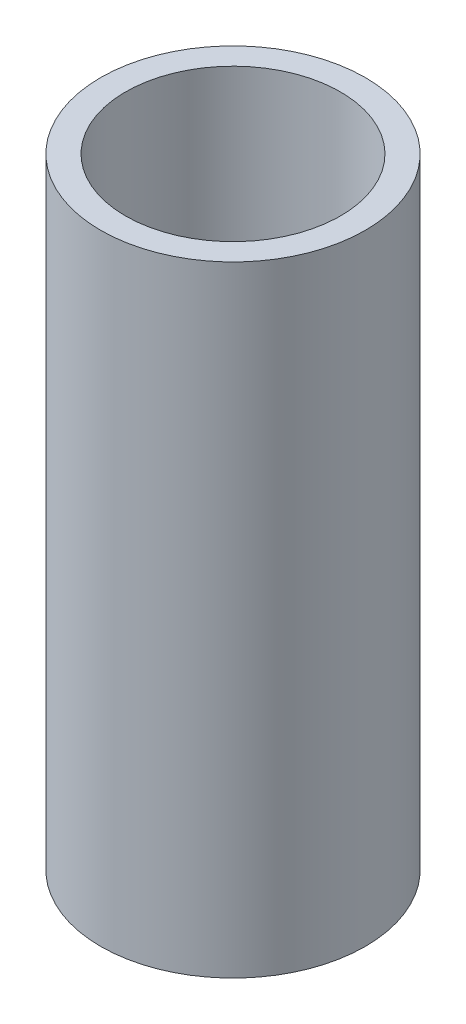
ISO-10303-21;
HEADER;
FILE_DESCRIPTION(('STEP AP214'),'2;1');
FILE_NAME('part.step','',(''),(''),'','','');
FILE_SCHEMA(('AUTOMOTIVE_DESIGN { 1 0 10303 214 1 1 1 1 }'));
ENDSEC;
DATA;
#1=APPLICATION_CONTEXT('core data for automotive mechanical design processes');
#2=APPLICATION_PROTOCOL_DEFINITION('international standard','automotive_design',2000,#1);
#3=PRODUCT_CONTEXT('',#1,'mechanical');
#4=PRODUCT('Part','Part','',(#3));
#5=PRODUCT_RELATED_PRODUCT_CATEGORY('part','',(#4));
#6=PRODUCT_DEFINITION_FORMATION('','',#4);
#7=PRODUCT_DEFINITION_CONTEXT('part definition',#1,'design');
#8=PRODUCT_DEFINITION('design','',#6,#7);
#9=PRODUCT_DEFINITION_SHAPE('','',#8);
#10=(LENGTH_UNIT() NAMED_UNIT(*) SI_UNIT(.MILLI.,.METRE.));
#11=(NAMED_UNIT(*) PLANE_ANGLE_UNIT() SI_UNIT($,.RADIAN.));
#12=(NAMED_UNIT(*) SI_UNIT($,.STERADIAN.) SOLID_ANGLE_UNIT());
#13=UNCERTAINTY_MEASURE_WITH_UNIT(LENGTH_MEASURE(1.E-05),#10,'distance_accuracy_value','');
#14=(GEOMETRIC_REPRESENTATION_CONTEXT(3) GLOBAL_UNCERTAINTY_ASSIGNED_CONTEXT((#13)) GLOBAL_UNIT_ASSIGNED_CONTEXT((#10,
#11,#12)) REPRESENTATION_CONTEXT('',''));
#15=CARTESIAN_POINT('',(0.,0.,0.));
#16=DIRECTION('',(0.,0.,1.));
#17=DIRECTION('',(1.,0.,0.));
#18=AXIS2_PLACEMENT_3D('',#15,#16,#17);
#19=CARTESIAN_POINT('',(0.,82.0234871998214,0.));
#20=DIRECTION('',(0.,-1.,0.));
#21=DIRECTION('',(0.,0.,-1.));
#22=AXIS2_PLACEMENT_3D('',#19,#20,#21);
#23=CYLINDRICAL_SURFACE('',#22,17.5);
#24=CARTESIAN_POINT('',(0.,82.0234871998214,0.));
#25=DIRECTION('',(0.,1.,0.));
#26=DIRECTION('',(0.,0.,1.));
#27=AXIS2_PLACEMENT_3D('',#24,#25,#26);
#28=CIRCLE('',#27,17.5);
#29=CARTESIAN_POINT('',(0.,82.0234871998214,17.5));
#30=VERTEX_POINT('',#29);
#31=EDGE_CURVE('E10',#30,#30,#28,.T.);
#32=ORIENTED_EDGE('',*,*,#31,.F.);
#33=EDGE_LOOP('',(#32));
#34=FACE_BOUND('',#33,.T.);
#35=CARTESIAN_POINT('',(0.,0.,0.));
#36=DIRECTION('',(0.,1.,0.));
#37=DIRECTION('',(0.,0.,1.));
#38=AXIS2_PLACEMENT_3D('',#35,#36,#37);
#39=CIRCLE('',#38,17.5);
#40=CARTESIAN_POINT('',(0.,0.,17.5));
#41=VERTEX_POINT('',#40);
#42=EDGE_CURVE('E37',#41,#41,#39,.T.);
#43=ORIENTED_EDGE('',*,*,#42,.T.);
#44=EDGE_LOOP('',(#43));
#45=FACE_BOUND('',#44,.T.);
#46=ADVANCED_FACE('F40',(#34,#45),#23,.T.);
#47=CARTESIAN_POINT('',(0.,82.0234871998214,0.));
#48=DIRECTION('',(0.,1.,0.));
#49=DIRECTION('',(0.,0.,1.));
#50=AXIS2_PLACEMENT_3D('',#47,#48,#49);
#51=PLANE('',#50);
#52=CARTESIAN_POINT('',(0.,82.0234871998214,0.));
#53=DIRECTION('',(0.,1.,0.));
#54=DIRECTION('',(0.,0.,1.));
#55=AXIS2_PLACEMENT_3D('',#52,#53,#54);
#56=CIRCLE('',#55,14.2152156994468);
#57=CARTESIAN_POINT('',(0.,82.0234871998214,14.2152156994468));
#58=VERTEX_POINT('',#57);
#59=EDGE_CURVE('E50',#58,#58,#56,.T.);
#60=ORIENTED_EDGE('',*,*,#59,.F.);
#61=EDGE_LOOP('',(#60));
#62=FACE_BOUND('',#61,.T.);
#63=ORIENTED_EDGE('',*,*,#31,.T.);
#64=EDGE_LOOP('',(#63));
#65=FACE_BOUND('',#64,.T.);
#66=ADVANCED_FACE('F59',(#62,#65),#51,.T.);
#67=CARTESIAN_POINT('',(0.,0.,0.));
#68=DIRECTION('',(0.,1.,0.));
#69=DIRECTION('',(0.,0.,1.));
#70=AXIS2_PLACEMENT_3D('',#67,#68,#69);
#71=PLANE('',#70);
#72=CARTESIAN_POINT('',(0.,0.,0.));
#73=DIRECTION('',(0.,1.,0.));
#74=DIRECTION('',(0.,0.,1.));
#75=AXIS2_PLACEMENT_3D('',#72,#73,#74);
#76=CIRCLE('',#75,14.2152156994468);
#77=CARTESIAN_POINT('',(0.,0.,14.2152156994468));
#78=VERTEX_POINT('',#77);
#79=EDGE_CURVE('E47',#78,#78,#76,.T.);
#80=ORIENTED_EDGE('',*,*,#79,.T.);
#81=EDGE_LOOP('',(#80));
#82=FACE_BOUND('',#81,.T.);
#83=ORIENTED_EDGE('',*,*,#42,.F.);
#84=EDGE_LOOP('',(#83));
#85=FACE_BOUND('',#84,.T.);
#86=ADVANCED_FACE('F58',(#82,#85),#71,.F.);
#87=CARTESIAN_POINT('',(0.,82.0234871998214,0.));
#88=DIRECTION('',(0.,-1.,0.));
#89=DIRECTION('',(0.,0.,-1.));
#90=AXIS2_PLACEMENT_3D('',#87,#88,#89);
#91=CYLINDRICAL_SURFACE('',#90,14.2152156994468);
#92=ORIENTED_EDGE('',*,*,#59,.T.);
#93=EDGE_LOOP('',(#92));
#94=FACE_BOUND('',#93,.T.);
#95=ORIENTED_EDGE('',*,*,#79,.F.);
#96=EDGE_LOOP('',(#95));
#97=FACE_BOUND('',#96,.T.);
#98=ADVANCED_FACE('F54',(#94,#97),#91,.F.);
#99=CLOSED_SHELL('',(#46,#66,#86,#98));
#100=MANIFOLD_SOLID_BREP('B2',#99);
#101=ADVANCED_BREP_SHAPE_REPRESENTATION('',(#18,#100),#14);
#102=SHAPE_DEFINITION_REPRESENTATION(#9,#101);
ENDSEC;
END-ISO-10303-21;
